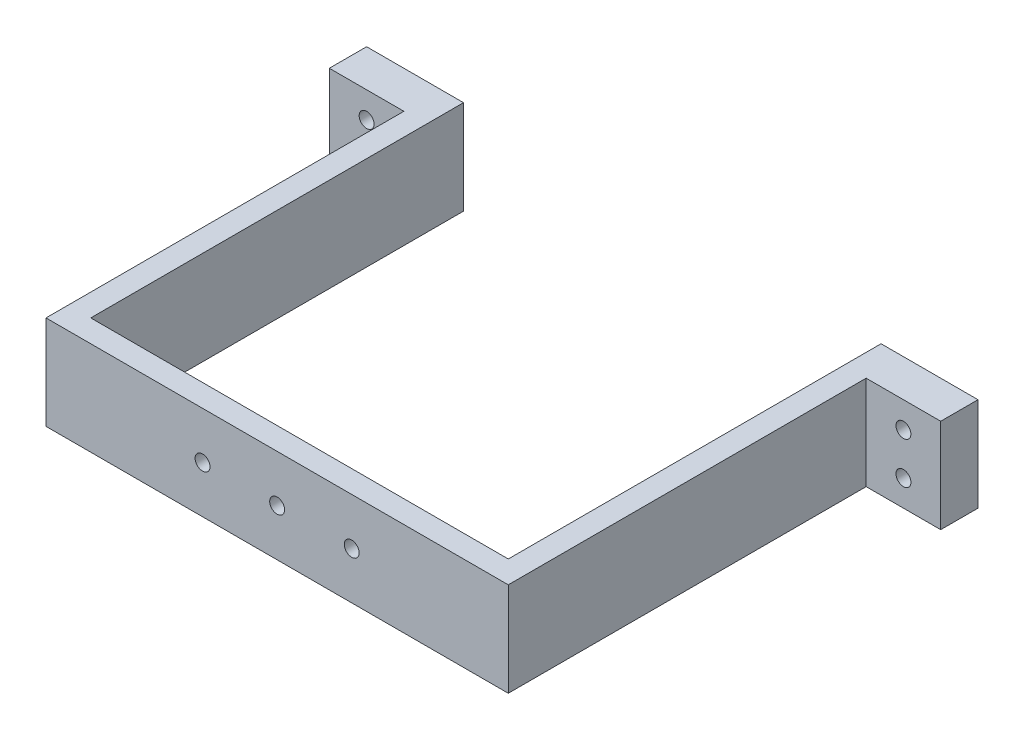
ISO-10303-21;
HEADER;
FILE_DESCRIPTION(('STEP AP214'),'2;1');
FILE_NAME('part.step','',(''),(''),'','','');
FILE_SCHEMA(('AUTOMOTIVE_DESIGN { 1 0 10303 214 1 1 1 1 }'));
ENDSEC;
DATA;
#1=APPLICATION_CONTEXT('core data for automotive mechanical design processes');
#2=APPLICATION_PROTOCOL_DEFINITION('international standard','automotive_design',2000,#1);
#3=PRODUCT_CONTEXT('',#1,'mechanical');
#4=PRODUCT('Part','Part','',(#3));
#5=PRODUCT_RELATED_PRODUCT_CATEGORY('part','',(#4));
#6=PRODUCT_DEFINITION_FORMATION('','',#4);
#7=PRODUCT_DEFINITION_CONTEXT('part definition',#1,'design');
#8=PRODUCT_DEFINITION('design','',#6,#7);
#9=PRODUCT_DEFINITION_SHAPE('','',#8);
#10=(LENGTH_UNIT() NAMED_UNIT(*) SI_UNIT(.MILLI.,.METRE.));
#11=(NAMED_UNIT(*) PLANE_ANGLE_UNIT() SI_UNIT($,.RADIAN.));
#12=(NAMED_UNIT(*) SI_UNIT($,.STERADIAN.) SOLID_ANGLE_UNIT());
#13=UNCERTAINTY_MEASURE_WITH_UNIT(LENGTH_MEASURE(1.E-05),#10,'distance_accuracy_value','');
#14=(GEOMETRIC_REPRESENTATION_CONTEXT(3) GLOBAL_UNCERTAINTY_ASSIGNED_CONTEXT((#13)) GLOBAL_UNIT_ASSIGNED_CONTEXT((#10,
#11,#12)) REPRESENTATION_CONTEXT('',''));
#15=CARTESIAN_POINT('',(0.,0.,0.));
#16=DIRECTION('',(0.,0.,1.));
#17=DIRECTION('',(1.,0.,0.));
#18=AXIS2_PLACEMENT_3D('',#15,#16,#17);
#19=CARTESIAN_POINT('',(0.,0.,0.));
#20=DIRECTION('',(0.,0.,1.));
#21=DIRECTION('',(1.,0.,0.));
#22=AXIS2_PLACEMENT_3D('',#19,#20,#21);
#23=PLANE('',#22);
#24=CARTESIAN_POINT('',(-10.,14.6977801084461,0.));
#25=DIRECTION('',(0.,0.,1.));
#26=DIRECTION('',(1.,0.,0.));
#27=AXIS2_PLACEMENT_3D('',#24,#25,#26);
#28=CIRCLE('',#27,1.);
#29=CARTESIAN_POINT('',(-9.,14.6977801084461,0.));
#30=VERTEX_POINT('',#29);
#31=EDGE_CURVE('E255',#30,#30,#28,.T.);
#32=ORIENTED_EDGE('',*,*,#31,.T.);
#33=EDGE_LOOP('',(#32));
#34=FACE_BOUND('',#33,.T.);
#35=CARTESIAN_POINT('',(10.,14.6977801084462,0.));
#36=DIRECTION('',(0.,0.,1.));
#37=DIRECTION('',(1.,0.,0.));
#38=AXIS2_PLACEMENT_3D('',#35,#36,#37);
#39=CIRCLE('',#38,1.);
#40=CARTESIAN_POINT('',(11.,14.6977801084462,0.));
#41=VERTEX_POINT('',#40);
#42=EDGE_CURVE('E249',#41,#41,#39,.T.);
#43=ORIENTED_EDGE('',*,*,#42,.T.);
#44=EDGE_LOOP('',(#43));
#45=FACE_BOUND('',#44,.T.);
#46=CARTESIAN_POINT('',(0.,14.6977801084462,0.));
#47=DIRECTION('',(0.,0.,1.));
#48=DIRECTION('',(1.,0.,0.));
#49=AXIS2_PLACEMENT_3D('',#46,#47,#48);
#50=CIRCLE('',#49,1.);
#51=CARTESIAN_POINT('',(1.,14.6977801084462,0.));
#52=VERTEX_POINT('',#51);
#53=EDGE_CURVE('E244',#52,#52,#50,.T.);
#54=ORIENTED_EDGE('',*,*,#53,.T.);
#55=EDGE_LOOP('',(#54));
#56=FACE_BOUND('',#55,.T.);
#57=DIRECTION('',(-1.,0.,0.));
#58=VECTOR('',#57,1.);
#59=CARTESIAN_POINT('',(0.,20.9977801084462,0.));
#60=LINE('',#59,#58);
#61=CARTESIAN_POINT('',(28.,20.9977801084462,0.));
#62=VERTEX_POINT('',#61);
#63=CARTESIAN_POINT('',(-28.,20.9977801084462,0.));
#64=VERTEX_POINT('',#63);
#65=EDGE_CURVE('E246',#62,#64,#60,.T.);
#66=ORIENTED_EDGE('',*,*,#65,.F.);
#67=DIRECTION('',(0.,-1.,0.));
#68=VECTOR('',#67,1.);
#69=CARTESIAN_POINT('',(28.,0.,0.));
#70=LINE('',#69,#68);
#71=CARTESIAN_POINT('',(28.,8.39778010844618,0.));
#72=VERTEX_POINT('',#71);
#73=EDGE_CURVE('E205',#62,#72,#70,.T.);
#74=ORIENTED_EDGE('',*,*,#73,.T.);
#75=DIRECTION('',(1.,0.,0.));
#76=VECTOR('',#75,1.);
#77=CARTESIAN_POINT('',(0.,8.39778010844618,0.));
#78=LINE('',#77,#76);
#79=CARTESIAN_POINT('',(-28.,8.39778010844618,0.));
#80=VERTEX_POINT('',#79);
#81=EDGE_CURVE('E248',#80,#72,#78,.T.);
#82=ORIENTED_EDGE('',*,*,#81,.F.);
#83=DIRECTION('',(0.,-1.,0.));
#84=VECTOR('',#83,1.);
#85=CARTESIAN_POINT('',(-28.,0.,0.));
#86=LINE('',#85,#84);
#87=EDGE_CURVE('E221',#64,#80,#86,.T.);
#88=ORIENTED_EDGE('',*,*,#87,.F.);
#89=EDGE_LOOP('',(#66,#74,#82,#88));
#90=FACE_BOUND('',#89,.T.);
#91=ADVANCED_FACE('F35',(#34,#45,#56,#90),#23,.F.);
#92=CARTESIAN_POINT('',(0.,20.9977801084462,3.));
#93=DIRECTION('',(0.,-1.,0.));
#94=DIRECTION('',(1.,0.,0.));
#95=AXIS2_PLACEMENT_3D('',#92,#93,#94);
#96=PLANE('',#95);
#97=DIRECTION('',(0.,0.,-1.));
#98=VECTOR('',#97,1.);
#99=CARTESIAN_POINT('',(31.,20.9977801084462,3.));
#100=LINE('',#99,#98);
#101=CARTESIAN_POINT('',(31.,20.9977801084462,3.));
#102=VERTEX_POINT('',#101);
#103=CARTESIAN_POINT('',(31.,20.9977801084462,-45.));
#104=VERTEX_POINT('',#103);
#105=EDGE_CURVE('E148',#102,#104,#100,.T.);
#106=ORIENTED_EDGE('',*,*,#105,.T.);
#107=DIRECTION('',(1.,0.,0.));
#108=VECTOR('',#107,1.);
#109=CARTESIAN_POINT('',(41.,20.9977801084462,-45.));
#110=LINE('',#109,#108);
#111=CARTESIAN_POINT('',(41.,20.9977801084462,-45.));
#112=VERTEX_POINT('',#111);
#113=EDGE_CURVE('E52',#104,#112,#110,.T.);
#114=ORIENTED_EDGE('',*,*,#113,.T.);
#115=DIRECTION('',(0.,0.,-1.));
#116=VECTOR('',#115,1.);
#117=CARTESIAN_POINT('',(41.,20.9977801084462,-45.));
#118=LINE('',#117,#116);
#119=CARTESIAN_POINT('',(41.,20.9977801084462,-50.));
#120=VERTEX_POINT('',#119);
#121=EDGE_CURVE('E129',#112,#120,#118,.T.);
#122=ORIENTED_EDGE('',*,*,#121,.T.);
#123=DIRECTION('',(-1.,0.,0.));
#124=VECTOR('',#123,1.);
#125=CARTESIAN_POINT('',(0.,20.9977801084462,-50.));
#126=LINE('',#125,#124);
#127=CARTESIAN_POINT('',(28.,20.9977801084462,-50.));
#128=VERTEX_POINT('',#127);
#129=EDGE_CURVE('E209',#120,#128,#126,.T.);
#130=ORIENTED_EDGE('',*,*,#129,.T.);
#131=DIRECTION('',(0.,0.,1.));
#132=VECTOR('',#131,1.);
#133=CARTESIAN_POINT('',(28.,20.9977801084462,-50.));
#134=LINE('',#133,#132);
#135=EDGE_CURVE('E216',#128,#62,#134,.T.);
#136=ORIENTED_EDGE('',*,*,#135,.T.);
#137=ORIENTED_EDGE('',*,*,#65,.T.);
#138=DIRECTION('',(0.,0.,1.));
#139=VECTOR('',#138,1.);
#140=CARTESIAN_POINT('',(-28.,20.9977801084462,-50.));
#141=LINE('',#140,#139);
#142=CARTESIAN_POINT('',(-28.,20.9977801084462,-50.));
#143=VERTEX_POINT('',#142);
#144=EDGE_CURVE('E241',#143,#64,#141,.T.);
#145=ORIENTED_EDGE('',*,*,#144,.F.);
#146=DIRECTION('',(-1.,0.,0.));
#147=VECTOR('',#146,1.);
#148=CARTESIAN_POINT('',(0.,20.9977801084462,-50.));
#149=LINE('',#148,#147);
#150=CARTESIAN_POINT('',(-41.,20.9977801084462,-50.));
#151=VERTEX_POINT('',#150);
#152=EDGE_CURVE('E223',#143,#151,#149,.T.);
#153=ORIENTED_EDGE('',*,*,#152,.T.);
#154=DIRECTION('',(0.,0.,-1.));
#155=VECTOR('',#154,1.);
#156=CARTESIAN_POINT('',(-41.,20.9977801084462,-45.));
#157=LINE('',#156,#155);
#158=CARTESIAN_POINT('',(-41.,20.9977801084462,-45.));
#159=VERTEX_POINT('',#158);
#160=EDGE_CURVE('E202',#159,#151,#157,.T.);
#161=ORIENTED_EDGE('',*,*,#160,.F.);
#162=DIRECTION('',(1.,0.,0.));
#163=VECTOR('',#162,1.);
#164=CARTESIAN_POINT('',(-41.,20.9977801084462,-45.));
#165=LINE('',#164,#163);
#166=CARTESIAN_POINT('',(-31.,20.9977801084462,-45.));
#167=VERTEX_POINT('',#166);
#168=EDGE_CURVE('E198',#159,#167,#165,.T.);
#169=ORIENTED_EDGE('',*,*,#168,.T.);
#170=DIRECTION('',(0.,0.,-1.));
#171=VECTOR('',#170,1.);
#172=CARTESIAN_POINT('',(-31.,20.9977801084462,3.));
#173=LINE('',#172,#171);
#174=CARTESIAN_POINT('',(-31.,20.9977801084462,3.));
#175=VERTEX_POINT('',#174);
#176=EDGE_CURVE('E11',#175,#167,#173,.T.);
#177=ORIENTED_EDGE('',*,*,#176,.F.);
#178=DIRECTION('',(-1.,0.,0.));
#179=VECTOR('',#178,1.);
#180=CARTESIAN_POINT('',(0.,20.9977801084462,3.));
#181=LINE('',#180,#179);
#182=EDGE_CURVE('E352',#102,#175,#181,.T.);
#183=ORIENTED_EDGE('',*,*,#182,.F.);
#184=EDGE_LOOP('',(#106,#114,#122,#130,#136,#137,#145,#153,#161,#169,#177,#183));
#185=FACE_BOUND('',#184,.T.);
#186=ADVANCED_FACE('F145',(#185),#96,.F.);
#187=CARTESIAN_POINT('',(-31.,0.,3.));
#188=DIRECTION('',(1.,0.,0.));
#189=DIRECTION('',(0.,0.,-1.));
#190=AXIS2_PLACEMENT_3D('',#187,#188,#189);
#191=PLANE('',#190);
#192=ORIENTED_EDGE('',*,*,#176,.T.);
#193=DIRECTION('',(0.,-1.,0.));
#194=VECTOR('',#193,1.);
#195=CARTESIAN_POINT('',(-31.,8.39778010844618,-45.));
#196=LINE('',#195,#194);
#197=CARTESIAN_POINT('',(-31.,8.39778010844618,-45.));
#198=VERTEX_POINT('',#197);
#199=EDGE_CURVE('E185',#167,#198,#196,.T.);
#200=ORIENTED_EDGE('',*,*,#199,.T.);
#201=DIRECTION('',(0.,0.,-1.));
#202=VECTOR('',#201,1.);
#203=CARTESIAN_POINT('',(-31.,8.39778010844618,3.));
#204=LINE('',#203,#202);
#205=CARTESIAN_POINT('',(-31.,8.39778010844618,3.));
#206=VERTEX_POINT('',#205);
#207=EDGE_CURVE('E44',#206,#198,#204,.T.);
#208=ORIENTED_EDGE('',*,*,#207,.F.);
#209=DIRECTION('',(0.,-1.,0.));
#210=VECTOR('',#209,1.);
#211=CARTESIAN_POINT('',(-31.,0.,3.));
#212=LINE('',#211,#210);
#213=EDGE_CURVE('E350',#175,#206,#212,.T.);
#214=ORIENTED_EDGE('',*,*,#213,.F.);
#215=EDGE_LOOP('',(#192,#200,#208,#214));
#216=FACE_BOUND('',#215,.T.);
#217=ADVANCED_FACE('F312',(#216),#191,.F.);
#218=CARTESIAN_POINT('',(0.,8.39778010844618,3.));
#219=DIRECTION('',(0.,1.,0.));
#220=DIRECTION('',(0.,0.,1.));
#221=AXIS2_PLACEMENT_3D('',#218,#219,#220);
#222=PLANE('',#221);
#223=ORIENTED_EDGE('',*,*,#207,.T.);
#224=DIRECTION('',(-1.,0.,0.));
#225=VECTOR('',#224,1.);
#226=CARTESIAN_POINT('',(-31.,8.39778010844618,-45.));
#227=LINE('',#226,#225);
#228=CARTESIAN_POINT('',(-41.,8.39778010844618,-45.));
#229=VERTEX_POINT('',#228);
#230=EDGE_CURVE('E60',#198,#229,#227,.T.);
#231=ORIENTED_EDGE('',*,*,#230,.T.);
#232=DIRECTION('',(0.,0.,-1.));
#233=VECTOR('',#232,1.);
#234=CARTESIAN_POINT('',(-41.,8.39778010844618,-45.));
#235=LINE('',#234,#233);
#236=CARTESIAN_POINT('',(-41.,8.39778010844618,-50.));
#237=VERTEX_POINT('',#236);
#238=EDGE_CURVE('E206',#229,#237,#235,.T.);
#239=ORIENTED_EDGE('',*,*,#238,.T.);
#240=DIRECTION('',(1.,0.,0.));
#241=VECTOR('',#240,1.);
#242=CARTESIAN_POINT('',(0.,8.39778010844618,-50.));
#243=LINE('',#242,#241);
#244=CARTESIAN_POINT('',(-28.,8.39778010844618,-50.));
#245=VERTEX_POINT('',#244);
#246=EDGE_CURVE('E225',#237,#245,#243,.T.);
#247=ORIENTED_EDGE('',*,*,#246,.T.);
#248=DIRECTION('',(0.,0.,1.));
#249=VECTOR('',#248,1.);
#250=CARTESIAN_POINT('',(-28.,8.39778010844618,-50.));
#251=LINE('',#250,#249);
#252=EDGE_CURVE('E230',#245,#80,#251,.T.);
#253=ORIENTED_EDGE('',*,*,#252,.T.);
#254=ORIENTED_EDGE('',*,*,#81,.T.);
#255=DIRECTION('',(0.,0.,1.));
#256=VECTOR('',#255,1.);
#257=CARTESIAN_POINT('',(28.,8.39778010844618,-50.));
#258=LINE('',#257,#256);
#259=CARTESIAN_POINT('',(28.,8.39778010844618,-50.));
#260=VERTEX_POINT('',#259);
#261=EDGE_CURVE('E219',#260,#72,#258,.T.);
#262=ORIENTED_EDGE('',*,*,#261,.F.);
#263=DIRECTION('',(1.,0.,0.));
#264=VECTOR('',#263,1.);
#265=CARTESIAN_POINT('',(0.,8.39778010844618,-50.));
#266=LINE('',#265,#264);
#267=CARTESIAN_POINT('',(41.,8.39778010844618,-50.));
#268=VERTEX_POINT('',#267);
#269=EDGE_CURVE('E214',#260,#268,#266,.T.);
#270=ORIENTED_EDGE('',*,*,#269,.T.);
#271=DIRECTION('',(0.,0.,-1.));
#272=VECTOR('',#271,1.);
#273=CARTESIAN_POINT('',(41.,8.39778010844618,-45.));
#274=LINE('',#273,#272);
#275=CARTESIAN_POINT('',(41.,8.39778010844618,-45.));
#276=VERTEX_POINT('',#275);
#277=EDGE_CURVE('E138',#276,#268,#274,.T.);
#278=ORIENTED_EDGE('',*,*,#277,.F.);
#279=DIRECTION('',(-1.,0.,0.));
#280=VECTOR('',#279,1.);
#281=CARTESIAN_POINT('',(31.,8.39778010844618,-45.));
#282=LINE('',#281,#280);
#283=CARTESIAN_POINT('',(31.,8.39778010844618,-45.));
#284=VERTEX_POINT('',#283);
#285=EDGE_CURVE('E139',#276,#284,#282,.T.);
#286=ORIENTED_EDGE('',*,*,#285,.T.);
#287=DIRECTION('',(0.,0.,-1.));
#288=VECTOR('',#287,1.);
#289=CARTESIAN_POINT('',(31.,8.39778010844618,3.));
#290=LINE('',#289,#288);
#291=CARTESIAN_POINT('',(31.,8.39778010844618,3.));
#292=VERTEX_POINT('',#291);
#293=EDGE_CURVE('E162',#292,#284,#290,.T.);
#294=ORIENTED_EDGE('',*,*,#293,.F.);
#295=DIRECTION('',(1.,0.,0.));
#296=VECTOR('',#295,1.);
#297=CARTESIAN_POINT('',(0.,8.39778010844618,3.));
#298=LINE('',#297,#296);
#299=EDGE_CURVE('E348',#206,#292,#298,.T.);
#300=ORIENTED_EDGE('',*,*,#299,.F.);
#301=EDGE_LOOP('',(#223,#231,#239,#247,#253,#254,#262,#270,#278,#286,#294,#300));
#302=FACE_BOUND('',#301,.T.);
#303=ADVANCED_FACE('F160',(#302),#222,.F.);
#304=CARTESIAN_POINT('',(31.,0.,3.));
#305=DIRECTION('',(-1.,0.,0.));
#306=DIRECTION('',(0.,0.,1.));
#307=AXIS2_PLACEMENT_3D('',#304,#305,#306);
#308=PLANE('',#307);
#309=ORIENTED_EDGE('',*,*,#293,.T.);
#310=DIRECTION('',(0.,1.,0.));
#311=VECTOR('',#310,1.);
#312=CARTESIAN_POINT('',(31.,8.39778010844618,-45.));
#313=LINE('',#312,#311);
#314=EDGE_CURVE('E149',#284,#104,#313,.T.);
#315=ORIENTED_EDGE('',*,*,#314,.T.);
#316=ORIENTED_EDGE('',*,*,#105,.F.);
#317=DIRECTION('',(0.,1.,0.));
#318=VECTOR('',#317,1.);
#319=CARTESIAN_POINT('',(31.,0.,3.));
#320=LINE('',#319,#318);
#321=EDGE_CURVE('E166',#292,#102,#320,.T.);
#322=ORIENTED_EDGE('',*,*,#321,.F.);
#323=EDGE_LOOP('',(#309,#315,#316,#322));
#324=FACE_BOUND('',#323,.T.);
#325=ADVANCED_FACE('F165',(#324),#308,.F.);
#326=CARTESIAN_POINT('',(10.,14.6977801084462,3.));
#327=DIRECTION('',(0.,0.,-1.));
#328=DIRECTION('',(-1.,0.,0.));
#329=AXIS2_PLACEMENT_3D('',#326,#327,#328);
#330=CYLINDRICAL_SURFACE('',#329,1.);
#331=CARTESIAN_POINT('',(10.,14.6977801084462,3.));
#332=DIRECTION('',(0.,0.,1.));
#333=DIRECTION('',(1.,0.,0.));
#334=AXIS2_PLACEMENT_3D('',#331,#332,#333);
#335=CIRCLE('',#334,1.);
#336=CARTESIAN_POINT('',(11.,14.6977801084462,3.));
#337=VERTEX_POINT('',#336);
#338=EDGE_CURVE('E338',#337,#337,#335,.T.);
#339=ORIENTED_EDGE('',*,*,#338,.T.);
#340=EDGE_LOOP('',(#339));
#341=FACE_BOUND('',#340,.T.);
#342=ORIENTED_EDGE('',*,*,#42,.F.);
#343=EDGE_LOOP('',(#342));
#344=FACE_BOUND('',#343,.T.);
#345=ADVANCED_FACE('F324',(#341,#344),#330,.F.);
#346=CARTESIAN_POINT('',(0.,14.6977801084462,3.));
#347=DIRECTION('',(0.,0.,-1.));
#348=DIRECTION('',(-1.,0.,0.));
#349=AXIS2_PLACEMENT_3D('',#346,#347,#348);
#350=CYLINDRICAL_SURFACE('',#349,1.);
#351=CARTESIAN_POINT('',(0.,14.6977801084462,3.));
#352=DIRECTION('',(0.,0.,1.));
#353=DIRECTION('',(1.,0.,0.));
#354=AXIS2_PLACEMENT_3D('',#351,#352,#353);
#355=CIRCLE('',#354,1.);
#356=CARTESIAN_POINT('',(1.,14.6977801084462,3.));
#357=VERTEX_POINT('',#356);
#358=EDGE_CURVE('E233',#357,#357,#355,.T.);
#359=ORIENTED_EDGE('',*,*,#358,.T.);
#360=EDGE_LOOP('',(#359));
#361=FACE_BOUND('',#360,.T.);
#362=ORIENTED_EDGE('',*,*,#53,.F.);
#363=EDGE_LOOP('',(#362));
#364=FACE_BOUND('',#363,.T.);
#365=ADVANCED_FACE('F37',(#361,#364),#350,.F.);
#366=CARTESIAN_POINT('',(-10.,14.6977801084461,3.));
#367=DIRECTION('',(0.,0.,-1.));
#368=DIRECTION('',(-1.,0.,0.));
#369=AXIS2_PLACEMENT_3D('',#366,#367,#368);
#370=CYLINDRICAL_SURFACE('',#369,1.);
#371=CARTESIAN_POINT('',(-10.,14.6977801084461,3.));
#372=DIRECTION('',(0.,0.,1.));
#373=DIRECTION('',(1.,0.,0.));
#374=AXIS2_PLACEMENT_3D('',#371,#372,#373);
#375=CIRCLE('',#374,1.);
#376=CARTESIAN_POINT('',(-9.,14.6977801084461,3.));
#377=VERTEX_POINT('',#376);
#378=EDGE_CURVE('E169',#377,#377,#375,.T.);
#379=ORIENTED_EDGE('',*,*,#378,.T.);
#380=EDGE_LOOP('',(#379));
#381=FACE_BOUND('',#380,.T.);
#382=ORIENTED_EDGE('',*,*,#31,.F.);
#383=EDGE_LOOP('',(#382));
#384=FACE_BOUND('',#383,.T.);
#385=ADVANCED_FACE('F318',(#381,#384),#370,.F.);
#386=CARTESIAN_POINT('',(0.,0.,3.));
#387=DIRECTION('',(0.,0.,1.));
#388=DIRECTION('',(1.,0.,0.));
#389=AXIS2_PLACEMENT_3D('',#386,#387,#388);
#390=PLANE('',#389);
#391=ORIENTED_EDGE('',*,*,#358,.F.);
#392=EDGE_LOOP('',(#391));
#393=FACE_BOUND('',#392,.T.);
#394=ORIENTED_EDGE('',*,*,#338,.F.);
#395=EDGE_LOOP('',(#394));
#396=FACE_BOUND('',#395,.T.);
#397=ORIENTED_EDGE('',*,*,#182,.T.);
#398=ORIENTED_EDGE('',*,*,#213,.T.);
#399=ORIENTED_EDGE('',*,*,#299,.T.);
#400=ORIENTED_EDGE('',*,*,#321,.T.);
#401=EDGE_LOOP('',(#397,#398,#399,#400));
#402=FACE_BOUND('',#401,.T.);
#403=ORIENTED_EDGE('',*,*,#378,.F.);
#404=EDGE_LOOP('',(#403));
#405=FACE_BOUND('',#404,.T.);
#406=ADVANCED_FACE('F302',(#393,#396,#402,#405),#390,.T.);
#407=CARTESIAN_POINT('',(-28.,0.,-50.));
#408=DIRECTION('',(-1.,0.,0.));
#409=DIRECTION('',(0.,-1.,0.));
#410=AXIS2_PLACEMENT_3D('',#407,#408,#409);
#411=PLANE('',#410);
#412=ORIENTED_EDGE('',*,*,#87,.T.);
#413=ORIENTED_EDGE('',*,*,#252,.F.);
#414=DIRECTION('',(0.,-1.,0.));
#415=VECTOR('',#414,1.);
#416=CARTESIAN_POINT('',(-28.,0.,-50.));
#417=LINE('',#416,#415);
#418=EDGE_CURVE('E228',#143,#245,#417,.T.);
#419=ORIENTED_EDGE('',*,*,#418,.F.);
#420=ORIENTED_EDGE('',*,*,#144,.T.);
#421=EDGE_LOOP('',(#412,#413,#419,#420));
#422=FACE_BOUND('',#421,.T.);
#423=ADVANCED_FACE('F262',(#422),#411,.F.);
#424=CARTESIAN_POINT('',(0.,0.,-50.));
#425=DIRECTION('',(0.,0.,1.));
#426=DIRECTION('',(1.,0.,0.));
#427=AXIS2_PLACEMENT_3D('',#424,#425,#426);
#428=PLANE('',#427);
#429=ORIENTED_EDGE('',*,*,#152,.F.);
#430=ORIENTED_EDGE('',*,*,#418,.T.);
#431=ORIENTED_EDGE('',*,*,#246,.F.);
#432=DIRECTION('',(0.,1.,0.));
#433=VECTOR('',#432,1.);
#434=CARTESIAN_POINT('',(-41.,8.39778010844618,-50.));
#435=LINE('',#434,#433);
#436=EDGE_CURVE('E188',#237,#151,#435,.T.);
#437=ORIENTED_EDGE('',*,*,#436,.T.);
#438=EDGE_LOOP('',(#429,#430,#431,#437));
#439=FACE_BOUND('',#438,.T.);
#440=CARTESIAN_POINT('',(-36.,17.4977801084462,-50.));
#441=DIRECTION('',(0.,0.,-1.));
#442=DIRECTION('',(-1.,0.,0.));
#443=AXIS2_PLACEMENT_3D('',#440,#441,#442);
#444=CIRCLE('',#443,0.999999999999998);
#445=CARTESIAN_POINT('',(-37.,17.4977801084462,-50.));
#446=VERTEX_POINT('',#445);
#447=EDGE_CURVE('E271',#446,#446,#444,.T.);
#448=ORIENTED_EDGE('',*,*,#447,.F.);
#449=EDGE_LOOP('',(#448));
#450=FACE_BOUND('',#449,.T.);
#451=CARTESIAN_POINT('',(-36.,11.8977801084462,-50.));
#452=DIRECTION('',(0.,0.,-1.));
#453=DIRECTION('',(-1.,0.,0.));
#454=AXIS2_PLACEMENT_3D('',#451,#452,#453);
#455=CIRCLE('',#454,0.999999999999998);
#456=CARTESIAN_POINT('',(-37.,11.8977801084462,-50.));
#457=VERTEX_POINT('',#456);
#458=EDGE_CURVE('E193',#457,#457,#455,.T.);
#459=ORIENTED_EDGE('',*,*,#458,.F.);
#460=EDGE_LOOP('',(#459));
#461=FACE_BOUND('',#460,.T.);
#462=ADVANCED_FACE('F293',(#439,#450,#461),#428,.F.);
#463=CARTESIAN_POINT('',(28.,0.,-50.));
#464=DIRECTION('',(-1.,0.,0.));
#465=DIRECTION('',(0.,-1.,0.));
#466=AXIS2_PLACEMENT_3D('',#463,#464,#465);
#467=PLANE('',#466);
#468=ORIENTED_EDGE('',*,*,#73,.F.);
#469=ORIENTED_EDGE('',*,*,#135,.F.);
#470=DIRECTION('',(0.,-1.,0.));
#471=VECTOR('',#470,1.);
#472=CARTESIAN_POINT('',(28.,0.,-50.));
#473=LINE('',#472,#471);
#474=EDGE_CURVE('E211',#128,#260,#473,.T.);
#475=ORIENTED_EDGE('',*,*,#474,.T.);
#476=ORIENTED_EDGE('',*,*,#261,.T.);
#477=EDGE_LOOP('',(#468,#469,#475,#476));
#478=FACE_BOUND('',#477,.T.);
#479=ADVANCED_FACE('F267',(#478),#467,.T.);
#480=CARTESIAN_POINT('',(0.,0.,-50.));
#481=DIRECTION('',(0.,0.,1.));
#482=DIRECTION('',(1.,0.,0.));
#483=AXIS2_PLACEMENT_3D('',#480,#481,#482);
#484=PLANE('',#483);
#485=ORIENTED_EDGE('',*,*,#129,.F.);
#486=DIRECTION('',(0.,-1.,0.));
#487=VECTOR('',#486,1.);
#488=CARTESIAN_POINT('',(41.,8.39778010844618,-50.));
#489=LINE('',#488,#487);
#490=EDGE_CURVE('E135',#120,#268,#489,.T.);
#491=ORIENTED_EDGE('',*,*,#490,.T.);
#492=ORIENTED_EDGE('',*,*,#269,.F.);
#493=ORIENTED_EDGE('',*,*,#474,.F.);
#494=EDGE_LOOP('',(#485,#491,#492,#493));
#495=FACE_BOUND('',#494,.T.);
#496=CARTESIAN_POINT('',(36.,17.4977801084462,-50.));
#497=DIRECTION('',(0.,0.,-1.));
#498=DIRECTION('',(-1.,0.,0.));
#499=AXIS2_PLACEMENT_3D('',#496,#497,#498);
#500=CIRCLE('',#499,0.999999999999998);
#501=CARTESIAN_POINT('',(35.,17.4977801084462,-50.));
#502=VERTEX_POINT('',#501);
#503=EDGE_CURVE('E461',#502,#502,#500,.T.);
#504=ORIENTED_EDGE('',*,*,#503,.F.);
#505=EDGE_LOOP('',(#504));
#506=FACE_BOUND('',#505,.T.);
#507=CARTESIAN_POINT('',(36.,11.8977801084462,-50.));
#508=DIRECTION('',(0.,0.,-1.));
#509=DIRECTION('',(-1.,0.,0.));
#510=AXIS2_PLACEMENT_3D('',#507,#508,#509);
#511=CIRCLE('',#510,0.999999999999998);
#512=CARTESIAN_POINT('',(35.,11.8977801084462,-50.));
#513=VERTEX_POINT('',#512);
#514=EDGE_CURVE('E278',#513,#513,#511,.T.);
#515=ORIENTED_EDGE('',*,*,#514,.F.);
#516=EDGE_LOOP('',(#515));
#517=FACE_BOUND('',#516,.T.);
#518=ADVANCED_FACE('F273',(#495,#506,#517),#484,.F.);
#519=CARTESIAN_POINT('',(-41.,8.39778010844618,-45.));
#520=DIRECTION('',(-1.,0.,0.));
#521=DIRECTION('',(0.,0.,1.));
#522=AXIS2_PLACEMENT_3D('',#519,#520,#521);
#523=PLANE('',#522);
#524=ORIENTED_EDGE('',*,*,#436,.F.);
#525=ORIENTED_EDGE('',*,*,#238,.F.);
#526=DIRECTION('',(0.,1.,0.));
#527=VECTOR('',#526,1.);
#528=CARTESIAN_POINT('',(-41.,8.39778010844618,-45.));
#529=LINE('',#528,#527);
#530=EDGE_CURVE('E195',#229,#159,#529,.T.);
#531=ORIENTED_EDGE('',*,*,#530,.T.);
#532=ORIENTED_EDGE('',*,*,#160,.T.);
#533=EDGE_LOOP('',(#524,#525,#531,#532));
#534=FACE_BOUND('',#533,.T.);
#535=ADVANCED_FACE('F371',(#534),#523,.T.);
#536=CARTESIAN_POINT('',(0.,0.,-45.));
#537=DIRECTION('',(0.,0.,-1.));
#538=DIRECTION('',(-1.,0.,0.));
#539=AXIS2_PLACEMENT_3D('',#536,#537,#538);
#540=PLANE('',#539);
#541=CARTESIAN_POINT('',(-36.,17.4977801084462,-45.));
#542=DIRECTION('',(0.,0.,-1.));
#543=DIRECTION('',(-1.,0.,0.));
#544=AXIS2_PLACEMENT_3D('',#541,#542,#543);
#545=CIRCLE('',#544,0.999999999999998);
#546=CARTESIAN_POINT('',(-37.,17.4977801084462,-45.));
#547=VERTEX_POINT('',#546);
#548=EDGE_CURVE('E281',#547,#547,#545,.T.);
#549=ORIENTED_EDGE('',*,*,#548,.T.);
#550=EDGE_LOOP('',(#549));
#551=FACE_BOUND('',#550,.T.);
#552=CARTESIAN_POINT('',(-36.,11.8977801084462,-45.));
#553=DIRECTION('',(0.,0.,-1.));
#554=DIRECTION('',(-1.,0.,0.));
#555=AXIS2_PLACEMENT_3D('',#552,#553,#554);
#556=CIRCLE('',#555,0.999999999999998);
#557=CARTESIAN_POINT('',(-37.,11.8977801084462,-45.));
#558=VERTEX_POINT('',#557);
#559=EDGE_CURVE('E201',#558,#558,#556,.T.);
#560=ORIENTED_EDGE('',*,*,#559,.T.);
#561=EDGE_LOOP('',(#560));
#562=FACE_BOUND('',#561,.T.);
#563=ORIENTED_EDGE('',*,*,#199,.F.);
#564=ORIENTED_EDGE('',*,*,#168,.F.);
#565=ORIENTED_EDGE('',*,*,#530,.F.);
#566=ORIENTED_EDGE('',*,*,#230,.F.);
#567=EDGE_LOOP('',(#563,#564,#565,#566));
#568=FACE_BOUND('',#567,.T.);
#569=ADVANCED_FACE('F372',(#551,#562,#568),#540,.F.);
#570=CARTESIAN_POINT('',(-36.,11.8977801084462,-45.));
#571=DIRECTION('',(0.,0.,-1.));
#572=DIRECTION('',(-1.,0.,0.));
#573=AXIS2_PLACEMENT_3D('',#570,#571,#572);
#574=CYLINDRICAL_SURFACE('',#573,0.999999999999998);
#575=ORIENTED_EDGE('',*,*,#559,.F.);
#576=EDGE_LOOP('',(#575));
#577=FACE_BOUND('',#576,.T.);
#578=ORIENTED_EDGE('',*,*,#458,.T.);
#579=EDGE_LOOP('',(#578));
#580=FACE_BOUND('',#579,.T.);
#581=ADVANCED_FACE('F291',(#577,#580),#574,.F.);
#582=CARTESIAN_POINT('',(-36.,17.4977801084462,-45.));
#583=DIRECTION('',(0.,0.,-1.));
#584=DIRECTION('',(-1.,0.,0.));
#585=AXIS2_PLACEMENT_3D('',#582,#583,#584);
#586=CYLINDRICAL_SURFACE('',#585,0.999999999999998);
#587=ORIENTED_EDGE('',*,*,#548,.F.);
#588=EDGE_LOOP('',(#587));
#589=FACE_BOUND('',#588,.T.);
#590=ORIENTED_EDGE('',*,*,#447,.T.);
#591=EDGE_LOOP('',(#590));
#592=FACE_BOUND('',#591,.T.);
#593=ADVANCED_FACE('F381',(#589,#592),#586,.F.);
#594=CARTESIAN_POINT('',(41.,8.39778010844618,-45.));
#595=DIRECTION('',(1.,0.,0.));
#596=DIRECTION('',(0.,0.,-1.));
#597=AXIS2_PLACEMENT_3D('',#594,#595,#596);
#598=PLANE('',#597);
#599=ORIENTED_EDGE('',*,*,#490,.F.);
#600=ORIENTED_EDGE('',*,*,#121,.F.);
#601=DIRECTION('',(0.,-1.,0.));
#602=VECTOR('',#601,1.);
#603=CARTESIAN_POINT('',(41.,8.39778010844618,-45.));
#604=LINE('',#603,#602);
#605=EDGE_CURVE('E132',#112,#276,#604,.T.);
#606=ORIENTED_EDGE('',*,*,#605,.T.);
#607=ORIENTED_EDGE('',*,*,#277,.T.);
#608=EDGE_LOOP('',(#599,#600,#606,#607));
#609=FACE_BOUND('',#608,.T.);
#610=ADVANCED_FACE('F130',(#609),#598,.T.);
#611=CARTESIAN_POINT('',(0.,0.,-45.));
#612=DIRECTION('',(0.,0.,1.));
#613=DIRECTION('',(1.,0.,0.));
#614=AXIS2_PLACEMENT_3D('',#611,#612,#613);
#615=PLANE('',#614);
#616=CARTESIAN_POINT('',(36.,17.4977801084462,-45.));
#617=DIRECTION('',(0.,0.,-1.));
#618=DIRECTION('',(-1.,0.,0.));
#619=AXIS2_PLACEMENT_3D('',#616,#617,#618);
#620=CIRCLE('',#619,0.999999999999998);
#621=CARTESIAN_POINT('',(35.,17.4977801084462,-45.));
#622=VERTEX_POINT('',#621);
#623=EDGE_CURVE('E458',#622,#622,#620,.T.);
#624=ORIENTED_EDGE('',*,*,#623,.T.);
#625=EDGE_LOOP('',(#624));
#626=FACE_BOUND('',#625,.T.);
#627=CARTESIAN_POINT('',(36.,11.8977801084462,-45.));
#628=DIRECTION('',(0.,0.,-1.));
#629=DIRECTION('',(-1.,0.,0.));
#630=AXIS2_PLACEMENT_3D('',#627,#628,#629);
#631=CIRCLE('',#630,0.999999999999998);
#632=CARTESIAN_POINT('',(35.,11.8977801084462,-45.));
#633=VERTEX_POINT('',#632);
#634=EDGE_CURVE('E275',#633,#633,#631,.T.);
#635=ORIENTED_EDGE('',*,*,#634,.T.);
#636=EDGE_LOOP('',(#635));
#637=FACE_BOUND('',#636,.T.);
#638=ORIENTED_EDGE('',*,*,#314,.F.);
#639=ORIENTED_EDGE('',*,*,#285,.F.);
#640=ORIENTED_EDGE('',*,*,#605,.F.);
#641=ORIENTED_EDGE('',*,*,#113,.F.);
#642=EDGE_LOOP('',(#638,#639,#640,#641));
#643=FACE_BOUND('',#642,.T.);
#644=ADVANCED_FACE('F141',(#626,#637,#643),#615,.T.);
#645=CARTESIAN_POINT('',(36.,11.8977801084462,-45.));
#646=DIRECTION('',(0.,0.,-1.));
#647=DIRECTION('',(-1.,0.,0.));
#648=AXIS2_PLACEMENT_3D('',#645,#646,#647);
#649=CYLINDRICAL_SURFACE('',#648,0.999999999999998);
#650=ORIENTED_EDGE('',*,*,#634,.F.);
#651=EDGE_LOOP('',(#650));
#652=FACE_BOUND('',#651,.T.);
#653=ORIENTED_EDGE('',*,*,#514,.T.);
#654=EDGE_LOOP('',(#653));
#655=FACE_BOUND('',#654,.T.);
#656=ADVANCED_FACE('F431',(#652,#655),#649,.F.);
#657=CARTESIAN_POINT('',(36.,17.4977801084462,-45.));
#658=DIRECTION('',(0.,0.,-1.));
#659=DIRECTION('',(-1.,0.,0.));
#660=AXIS2_PLACEMENT_3D('',#657,#658,#659);
#661=CYLINDRICAL_SURFACE('',#660,0.999999999999998);
#662=ORIENTED_EDGE('',*,*,#623,.F.);
#663=EDGE_LOOP('',(#662));
#664=FACE_BOUND('',#663,.T.);
#665=ORIENTED_EDGE('',*,*,#503,.T.);
#666=EDGE_LOOP('',(#665));
#667=FACE_BOUND('',#666,.T.);
#668=ADVANCED_FACE('F441',(#664,#667),#661,.F.);
#669=CLOSED_SHELL('',(#91,#186,#217,#303,#325,#345,#365,#385,#406,#423,#462,#479,#518,#535,#569,
#581,#593,#610,#644,#656,#668));
#670=MANIFOLD_SOLID_BREP('B2',#669);
#671=ADVANCED_BREP_SHAPE_REPRESENTATION('',(#18,#670),#14);
#672=SHAPE_DEFINITION_REPRESENTATION(#9,#671);
ENDSEC;
END-ISO-10303-21;
